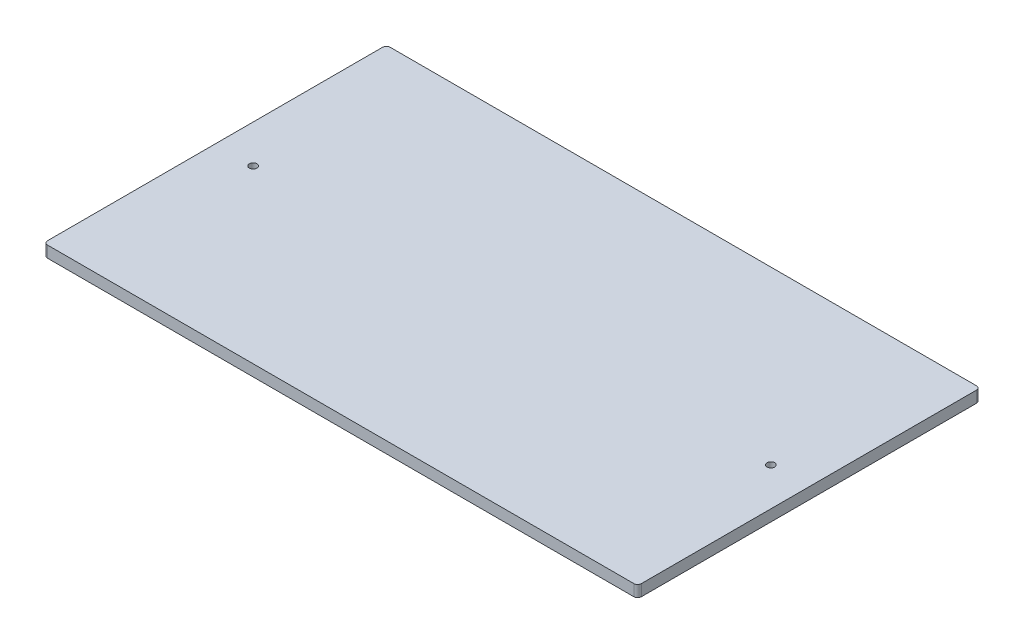
ISO-10303-21;
HEADER;
FILE_DESCRIPTION(('STEP AP214'),'2;1');
FILE_NAME('part.step','',(''),(''),'','','');
FILE_SCHEMA(('AUTOMOTIVE_DESIGN { 1 0 10303 214 1 1 1 1 }'));
ENDSEC;
DATA;
#1=APPLICATION_CONTEXT('core data for automotive mechanical design processes');
#2=APPLICATION_PROTOCOL_DEFINITION('international standard','automotive_design',2000,#1);
#3=PRODUCT_CONTEXT('',#1,'mechanical');
#4=PRODUCT('Part','Part','',(#3));
#5=PRODUCT_RELATED_PRODUCT_CATEGORY('part','',(#4));
#6=PRODUCT_DEFINITION_FORMATION('','',#4);
#7=PRODUCT_DEFINITION_CONTEXT('part definition',#1,'design');
#8=PRODUCT_DEFINITION('design','',#6,#7);
#9=PRODUCT_DEFINITION_SHAPE('','',#8);
#10=(LENGTH_UNIT() NAMED_UNIT(*) SI_UNIT(.MILLI.,.METRE.));
#11=(NAMED_UNIT(*) PLANE_ANGLE_UNIT() SI_UNIT($,.RADIAN.));
#12=(NAMED_UNIT(*) SI_UNIT($,.STERADIAN.) SOLID_ANGLE_UNIT());
#13=UNCERTAINTY_MEASURE_WITH_UNIT(LENGTH_MEASURE(1.E-05),#10,'distance_accuracy_value','');
#14=(GEOMETRIC_REPRESENTATION_CONTEXT(3) GLOBAL_UNCERTAINTY_ASSIGNED_CONTEXT((#13)) GLOBAL_UNIT_ASSIGNED_CONTEXT((#10,
#11,#12)) REPRESENTATION_CONTEXT('',''));
#15=CARTESIAN_POINT('',(0.,0.,0.));
#16=DIRECTION('',(0.,0.,1.));
#17=DIRECTION('',(1.,0.,0.));
#18=AXIS2_PLACEMENT_3D('',#15,#16,#17);
#19=CARTESIAN_POINT('',(0.,3.,0.));
#20=DIRECTION('',(1.,0.,0.));
#21=DIRECTION('',(0.,0.,-1.));
#22=AXIS2_PLACEMENT_3D('',#19,#20,#21);
#23=PLANE('',#22);
#24=DIRECTION('',(0.,0.,1.));
#25=VECTOR('',#24,1.);
#26=CARTESIAN_POINT('',(0.,3.,0.));
#27=LINE('',#26,#25);
#28=CARTESIAN_POINT('',(0.,3.,-89.));
#29=VERTEX_POINT('',#28);
#30=CARTESIAN_POINT('',(0.,3.,-1.));
#31=VERTEX_POINT('',#30);
#32=EDGE_CURVE('E124',#29,#31,#27,.T.);
#33=ORIENTED_EDGE('',*,*,#32,.F.);
#34=DIRECTION('',(0.,-1.,0.));
#35=VECTOR('',#34,1.);
#36=CARTESIAN_POINT('',(0.,3.,-89.));
#37=LINE('',#36,#35);
#38=CARTESIAN_POINT('',(0.,0.,-89.));
#39=VERTEX_POINT('',#38);
#40=EDGE_CURVE('E109',#29,#39,#37,.T.);
#41=ORIENTED_EDGE('',*,*,#40,.T.);
#42=DIRECTION('',(0.,0.,1.));
#43=VECTOR('',#42,1.);
#44=CARTESIAN_POINT('',(0.,0.,0.));
#45=LINE('',#44,#43);
#46=CARTESIAN_POINT('',(0.,0.,-1.));
#47=VERTEX_POINT('',#46);
#48=EDGE_CURVE('E121',#39,#47,#45,.T.);
#49=ORIENTED_EDGE('',*,*,#48,.T.);
#50=DIRECTION('',(0.,-1.,0.));
#51=VECTOR('',#50,1.);
#52=CARTESIAN_POINT('',(0.,3.,-1.));
#53=LINE('',#52,#51);
#54=EDGE_CURVE('E126',#47,#31,#53,.F.);
#55=ORIENTED_EDGE('',*,*,#54,.T.);
#56=EDGE_LOOP('',(#33,#41,#49,#55));
#57=FACE_BOUND('',#56,.T.);
#58=ADVANCED_FACE('F39',(#57),#23,.F.);
#59=CARTESIAN_POINT('',(0.,3.,0.));
#60=DIRECTION('',(0.,0.,-1.));
#61=DIRECTION('',(-1.,0.,0.));
#62=AXIS2_PLACEMENT_3D('',#59,#60,#61);
#63=PLANE('',#62);
#64=DIRECTION('',(1.,0.,0.));
#65=VECTOR('',#64,1.);
#66=CARTESIAN_POINT('',(0.,0.,0.));
#67=LINE('',#66,#65);
#68=CARTESIAN_POINT('',(1.,0.,0.));
#69=VERTEX_POINT('',#68);
#70=CARTESIAN_POINT('',(155.,0.,0.));
#71=VERTEX_POINT('',#70);
#72=EDGE_CURVE('E130',#69,#71,#67,.T.);
#73=ORIENTED_EDGE('',*,*,#72,.T.);
#74=DIRECTION('',(0.,-1.,0.));
#75=VECTOR('',#74,1.);
#76=CARTESIAN_POINT('',(155.,3.,0.));
#77=LINE('',#76,#75);
#78=CARTESIAN_POINT('',(155.,3.,0.));
#79=VERTEX_POINT('',#78);
#80=EDGE_CURVE('E11',#71,#79,#77,.F.);
#81=ORIENTED_EDGE('',*,*,#80,.T.);
#82=DIRECTION('',(1.,0.,0.));
#83=VECTOR('',#82,1.);
#84=CARTESIAN_POINT('',(0.,3.,0.));
#85=LINE('',#84,#83);
#86=CARTESIAN_POINT('',(1.,3.,0.));
#87=VERTEX_POINT('',#86);
#88=EDGE_CURVE('E170',#87,#79,#85,.T.);
#89=ORIENTED_EDGE('',*,*,#88,.F.);
#90=DIRECTION('',(0.,-1.,0.));
#91=VECTOR('',#90,1.);
#92=CARTESIAN_POINT('',(1.,3.,0.));
#93=LINE('',#92,#91);
#94=EDGE_CURVE('E47',#87,#69,#93,.T.);
#95=ORIENTED_EDGE('',*,*,#94,.T.);
#96=EDGE_LOOP('',(#73,#81,#89,#95));
#97=FACE_BOUND('',#96,.T.);
#98=ADVANCED_FACE('F168',(#97),#63,.F.);
#99=CARTESIAN_POINT('',(156.,3.,0.));
#100=DIRECTION('',(-1.,0.,0.));
#101=DIRECTION('',(0.,0.,1.));
#102=AXIS2_PLACEMENT_3D('',#99,#100,#101);
#103=PLANE('',#102);
#104=DIRECTION('',(0.,0.,-1.));
#105=VECTOR('',#104,1.);
#106=CARTESIAN_POINT('',(156.,0.,0.));
#107=LINE('',#106,#105);
#108=CARTESIAN_POINT('',(156.,0.,-1.));
#109=VERTEX_POINT('',#108);
#110=CARTESIAN_POINT('',(156.,0.,-89.));
#111=VERTEX_POINT('',#110);
#112=EDGE_CURVE('E134',#109,#111,#107,.T.);
#113=ORIENTED_EDGE('',*,*,#112,.T.);
#114=DIRECTION('',(0.,-1.,0.));
#115=VECTOR('',#114,1.);
#116=CARTESIAN_POINT('',(156.,3.,-89.));
#117=LINE('',#116,#115);
#118=CARTESIAN_POINT('',(156.,3.,-89.));
#119=VERTEX_POINT('',#118);
#120=EDGE_CURVE('E54',#111,#119,#117,.F.);
#121=ORIENTED_EDGE('',*,*,#120,.T.);
#122=DIRECTION('',(0.,0.,-1.));
#123=VECTOR('',#122,1.);
#124=CARTESIAN_POINT('',(156.,3.,0.));
#125=LINE('',#124,#123);
#126=CARTESIAN_POINT('',(156.,3.,-1.));
#127=VERTEX_POINT('',#126);
#128=EDGE_CURVE('E178',#127,#119,#125,.T.);
#129=ORIENTED_EDGE('',*,*,#128,.F.);
#130=DIRECTION('',(0.,-1.,0.));
#131=VECTOR('',#130,1.);
#132=CARTESIAN_POINT('',(156.,3.,-1.));
#133=LINE('',#132,#131);
#134=EDGE_CURVE('E161',#127,#109,#133,.T.);
#135=ORIENTED_EDGE('',*,*,#134,.T.);
#136=EDGE_LOOP('',(#113,#121,#129,#135));
#137=FACE_BOUND('',#136,.T.);
#138=ADVANCED_FACE('F177',(#137),#103,.F.);
#139=CARTESIAN_POINT('',(0.,3.,-90.));
#140=DIRECTION('',(0.,0.,1.));
#141=DIRECTION('',(1.,0.,0.));
#142=AXIS2_PLACEMENT_3D('',#139,#140,#141);
#143=PLANE('',#142);
#144=DIRECTION('',(-1.,0.,0.));
#145=VECTOR('',#144,1.);
#146=CARTESIAN_POINT('',(0.,0.,-90.));
#147=LINE('',#146,#145);
#148=CARTESIAN_POINT('',(155.,0.,-90.));
#149=VERTEX_POINT('',#148);
#150=CARTESIAN_POINT('',(1.,0.,-90.));
#151=VERTEX_POINT('',#150);
#152=EDGE_CURVE('E144',#149,#151,#147,.T.);
#153=ORIENTED_EDGE('',*,*,#152,.T.);
#154=DIRECTION('',(0.,-1.,0.));
#155=VECTOR('',#154,1.);
#156=CARTESIAN_POINT('',(1.,3.,-90.));
#157=LINE('',#156,#155);
#158=CARTESIAN_POINT('',(1.,3.,-90.));
#159=VERTEX_POINT('',#158);
#160=EDGE_CURVE('E110',#151,#159,#157,.F.);
#161=ORIENTED_EDGE('',*,*,#160,.T.);
#162=DIRECTION('',(-1.,0.,0.));
#163=VECTOR('',#162,1.);
#164=CARTESIAN_POINT('',(0.,3.,-90.));
#165=LINE('',#164,#163);
#166=CARTESIAN_POINT('',(155.,3.,-90.));
#167=VERTEX_POINT('',#166);
#168=EDGE_CURVE('E140',#167,#159,#165,.T.);
#169=ORIENTED_EDGE('',*,*,#168,.F.);
#170=DIRECTION('',(0.,-1.,0.));
#171=VECTOR('',#170,1.);
#172=CARTESIAN_POINT('',(155.,3.,-90.));
#173=LINE('',#172,#171);
#174=EDGE_CURVE('E115',#167,#149,#173,.T.);
#175=ORIENTED_EDGE('',*,*,#174,.T.);
#176=EDGE_LOOP('',(#153,#161,#169,#175));
#177=FACE_BOUND('',#176,.T.);
#178=ADVANCED_FACE('F198',(#177),#143,.F.);
#179=CARTESIAN_POINT('',(0.,3.,0.));
#180=DIRECTION('',(0.,-1.,0.));
#181=DIRECTION('',(0.,0.,-1.));
#182=AXIS2_PLACEMENT_3D('',#179,#180,#181);
#183=PLANE('',#182);
#184=CARTESIAN_POINT('',(146.,3.,-45.));
#185=DIRECTION('',(0.,1.,0.));
#186=DIRECTION('',(0.,0.,1.));
#187=AXIS2_PLACEMENT_3D('',#184,#185,#186);
#188=CIRCLE('',#187,0.999999999999998);
#189=CARTESIAN_POINT('',(146.,3.,-44.));
#190=VERTEX_POINT('',#189);
#191=EDGE_CURVE('E137',#190,#190,#188,.T.);
#192=ORIENTED_EDGE('',*,*,#191,.F.);
#193=EDGE_LOOP('',(#192));
#194=FACE_BOUND('',#193,.T.);
#195=CARTESIAN_POINT('',(10.,3.,-45.));
#196=DIRECTION('',(0.,1.,0.));
#197=DIRECTION('',(0.,0.,1.));
#198=AXIS2_PLACEMENT_3D('',#195,#196,#197);
#199=CIRCLE('',#198,1.);
#200=CARTESIAN_POINT('',(10.,3.,-44.));
#201=VERTEX_POINT('',#200);
#202=EDGE_CURVE('E184',#201,#201,#199,.T.);
#203=ORIENTED_EDGE('',*,*,#202,.F.);
#204=EDGE_LOOP('',(#203));
#205=FACE_BOUND('',#204,.T.);
#206=ORIENTED_EDGE('',*,*,#168,.T.);
#207=CARTESIAN_POINT('',(1.,3.,-89.));
#208=DIRECTION('',(0.,-1.,0.));
#209=DIRECTION('',(0.,0.,-1.));
#210=AXIS2_PLACEMENT_3D('',#207,#208,#209);
#211=CIRCLE('',#210,1.);
#212=EDGE_CURVE('E159',#159,#29,#211,.F.);
#213=ORIENTED_EDGE('',*,*,#212,.T.);
#214=ORIENTED_EDGE('',*,*,#32,.T.);
#215=CARTESIAN_POINT('',(1.,3.,-1.));
#216=DIRECTION('',(0.,-1.,0.));
#217=DIRECTION('',(0.,0.,-1.));
#218=AXIS2_PLACEMENT_3D('',#215,#216,#217);
#219=CIRCLE('',#218,1.);
#220=EDGE_CURVE('E154',#31,#87,#219,.F.);
#221=ORIENTED_EDGE('',*,*,#220,.T.);
#222=ORIENTED_EDGE('',*,*,#88,.T.);
#223=CARTESIAN_POINT('',(155.,3.,-1.));
#224=DIRECTION('',(0.,-1.,0.));
#225=DIRECTION('',(0.,0.,-1.));
#226=AXIS2_PLACEMENT_3D('',#223,#224,#225);
#227=CIRCLE('',#226,1.);
#228=EDGE_CURVE('E61',#79,#127,#227,.F.);
#229=ORIENTED_EDGE('',*,*,#228,.T.);
#230=ORIENTED_EDGE('',*,*,#128,.T.);
#231=CARTESIAN_POINT('',(155.,3.,-89.));
#232=DIRECTION('',(0.,-1.,0.));
#233=DIRECTION('',(0.,0.,-1.));
#234=AXIS2_PLACEMENT_3D('',#231,#232,#233);
#235=CIRCLE('',#234,1.);
#236=EDGE_CURVE('E157',#119,#167,#235,.F.);
#237=ORIENTED_EDGE('',*,*,#236,.T.);
#238=EDGE_LOOP('',(#206,#213,#214,#221,#222,#229,#230,#237));
#239=FACE_BOUND('',#238,.T.);
#240=ADVANCED_FACE('F195',(#194,#205,#239),#183,.F.);
#241=CARTESIAN_POINT('',(0.,0.,0.));
#242=DIRECTION('',(0.,-1.,0.));
#243=DIRECTION('',(0.,0.,-1.));
#244=AXIS2_PLACEMENT_3D('',#241,#242,#243);
#245=PLANE('',#244);
#246=CARTESIAN_POINT('',(146.,0.,-45.));
#247=DIRECTION('',(0.,1.,0.));
#248=DIRECTION('',(0.,0.,1.));
#249=AXIS2_PLACEMENT_3D('',#246,#247,#248);
#250=CIRCLE('',#249,0.999999999999998);
#251=CARTESIAN_POINT('',(146.,0.,-44.));
#252=VERTEX_POINT('',#251);
#253=EDGE_CURVE('E131',#252,#252,#250,.T.);
#254=ORIENTED_EDGE('',*,*,#253,.T.);
#255=EDGE_LOOP('',(#254));
#256=FACE_BOUND('',#255,.T.);
#257=CARTESIAN_POINT('',(10.,0.,-45.));
#258=DIRECTION('',(0.,1.,0.));
#259=DIRECTION('',(0.,0.,1.));
#260=AXIS2_PLACEMENT_3D('',#257,#258,#259);
#261=CIRCLE('',#260,1.);
#262=CARTESIAN_POINT('',(10.,0.,-44.));
#263=VERTEX_POINT('',#262);
#264=EDGE_CURVE('E187',#263,#263,#261,.T.);
#265=ORIENTED_EDGE('',*,*,#264,.T.);
#266=EDGE_LOOP('',(#265));
#267=FACE_BOUND('',#266,.T.);
#268=ORIENTED_EDGE('',*,*,#48,.F.);
#269=CARTESIAN_POINT('',(1.,0.,-89.));
#270=DIRECTION('',(0.,-1.,0.));
#271=DIRECTION('',(0.,0.,-1.));
#272=AXIS2_PLACEMENT_3D('',#269,#270,#271);
#273=CIRCLE('',#272,1.);
#274=EDGE_CURVE('E105',#39,#151,#273,.T.);
#275=ORIENTED_EDGE('',*,*,#274,.T.);
#276=ORIENTED_EDGE('',*,*,#152,.F.);
#277=CARTESIAN_POINT('',(155.,0.,-89.));
#278=DIRECTION('',(0.,-1.,0.));
#279=DIRECTION('',(0.,0.,-1.));
#280=AXIS2_PLACEMENT_3D('',#277,#278,#279);
#281=CIRCLE('',#280,1.);
#282=EDGE_CURVE('E116',#149,#111,#281,.T.);
#283=ORIENTED_EDGE('',*,*,#282,.T.);
#284=ORIENTED_EDGE('',*,*,#112,.F.);
#285=CARTESIAN_POINT('',(155.,0.,-1.));
#286=DIRECTION('',(0.,-1.,0.));
#287=DIRECTION('',(0.,0.,-1.));
#288=AXIS2_PLACEMENT_3D('',#285,#286,#287);
#289=CIRCLE('',#288,1.);
#290=EDGE_CURVE('E148',#109,#71,#289,.T.);
#291=ORIENTED_EDGE('',*,*,#290,.T.);
#292=ORIENTED_EDGE('',*,*,#72,.F.);
#293=CARTESIAN_POINT('',(1.,0.,-1.));
#294=DIRECTION('',(0.,-1.,0.));
#295=DIRECTION('',(0.,0.,-1.));
#296=AXIS2_PLACEMENT_3D('',#293,#294,#295);
#297=CIRCLE('',#296,1.);
#298=EDGE_CURVE('E125',#69,#47,#297,.T.);
#299=ORIENTED_EDGE('',*,*,#298,.T.);
#300=EDGE_LOOP('',(#268,#275,#276,#283,#284,#291,#292,#299));
#301=FACE_BOUND('',#300,.T.);
#302=ADVANCED_FACE('F128',(#256,#267,#301),#245,.T.);
#303=CARTESIAN_POINT('',(1.,3.,-89.));
#304=DIRECTION('',(0.,-1.,0.));
#305=DIRECTION('',(0.,0.,-1.));
#306=AXIS2_PLACEMENT_3D('',#303,#304,#305);
#307=CYLINDRICAL_SURFACE('',#306,1.);
#308=ORIENTED_EDGE('',*,*,#212,.F.);
#309=ORIENTED_EDGE('',*,*,#160,.F.);
#310=ORIENTED_EDGE('',*,*,#274,.F.);
#311=ORIENTED_EDGE('',*,*,#40,.F.);
#312=EDGE_LOOP('',(#308,#309,#310,#311));
#313=FACE_BOUND('',#312,.T.);
#314=ADVANCED_FACE('F108',(#313),#307,.T.);
#315=CARTESIAN_POINT('',(155.,3.,-89.));
#316=DIRECTION('',(0.,-1.,0.));
#317=DIRECTION('',(0.,0.,-1.));
#318=AXIS2_PLACEMENT_3D('',#315,#316,#317);
#319=CYLINDRICAL_SURFACE('',#318,1.);
#320=ORIENTED_EDGE('',*,*,#236,.F.);
#321=ORIENTED_EDGE('',*,*,#120,.F.);
#322=ORIENTED_EDGE('',*,*,#282,.F.);
#323=ORIENTED_EDGE('',*,*,#174,.F.);
#324=EDGE_LOOP('',(#320,#321,#322,#323));
#325=FACE_BOUND('',#324,.T.);
#326=ADVANCED_FACE('F205',(#325),#319,.T.);
#327=CARTESIAN_POINT('',(155.,3.,-1.));
#328=DIRECTION('',(0.,-1.,0.));
#329=DIRECTION('',(0.,0.,-1.));
#330=AXIS2_PLACEMENT_3D('',#327,#328,#329);
#331=CYLINDRICAL_SURFACE('',#330,1.);
#332=ORIENTED_EDGE('',*,*,#228,.F.);
#333=ORIENTED_EDGE('',*,*,#80,.F.);
#334=ORIENTED_EDGE('',*,*,#290,.F.);
#335=ORIENTED_EDGE('',*,*,#134,.F.);
#336=EDGE_LOOP('',(#332,#333,#334,#335));
#337=FACE_BOUND('',#336,.T.);
#338=ADVANCED_FACE('F176',(#337),#331,.T.);
#339=CARTESIAN_POINT('',(1.,3.,-1.));
#340=DIRECTION('',(0.,-1.,0.));
#341=DIRECTION('',(0.,0.,-1.));
#342=AXIS2_PLACEMENT_3D('',#339,#340,#341);
#343=CYLINDRICAL_SURFACE('',#342,1.);
#344=ORIENTED_EDGE('',*,*,#220,.F.);
#345=ORIENTED_EDGE('',*,*,#54,.F.);
#346=ORIENTED_EDGE('',*,*,#298,.F.);
#347=ORIENTED_EDGE('',*,*,#94,.F.);
#348=EDGE_LOOP('',(#344,#345,#346,#347));
#349=FACE_BOUND('',#348,.T.);
#350=ADVANCED_FACE('F41',(#349),#343,.T.);
#351=CARTESIAN_POINT('',(10.,0.,-45.));
#352=DIRECTION('',(0.,1.,0.));
#353=DIRECTION('',(0.,0.,1.));
#354=AXIS2_PLACEMENT_3D('',#351,#352,#353);
#355=CYLINDRICAL_SURFACE('',#354,1.);
#356=ORIENTED_EDGE('',*,*,#264,.F.);
#357=EDGE_LOOP('',(#356));
#358=FACE_BOUND('',#357,.T.);
#359=ORIENTED_EDGE('',*,*,#202,.T.);
#360=EDGE_LOOP('',(#359));
#361=FACE_BOUND('',#360,.T.);
#362=ADVANCED_FACE('F227',(#358,#361),#355,.F.);
#363=CARTESIAN_POINT('',(146.,0.,-45.));
#364=DIRECTION('',(0.,1.,0.));
#365=DIRECTION('',(0.,0.,1.));
#366=AXIS2_PLACEMENT_3D('',#363,#364,#365);
#367=CYLINDRICAL_SURFACE('',#366,0.999999999999998);
#368=ORIENTED_EDGE('',*,*,#253,.F.);
#369=EDGE_LOOP('',(#368));
#370=FACE_BOUND('',#369,.T.);
#371=ORIENTED_EDGE('',*,*,#191,.T.);
#372=EDGE_LOOP('',(#371));
#373=FACE_BOUND('',#372,.T.);
#374=ADVANCED_FACE('F193',(#370,#373),#367,.F.);
#375=CLOSED_SHELL('',(#58,#98,#138,#178,#240,#302,#314,#326,#338,#350,#362,#374));
#376=MANIFOLD_SOLID_BREP('B2',#375);
#377=ADVANCED_BREP_SHAPE_REPRESENTATION('',(#18,#376),#14);
#378=SHAPE_DEFINITION_REPRESENTATION(#9,#377);
ENDSEC;
END-ISO-10303-21;
